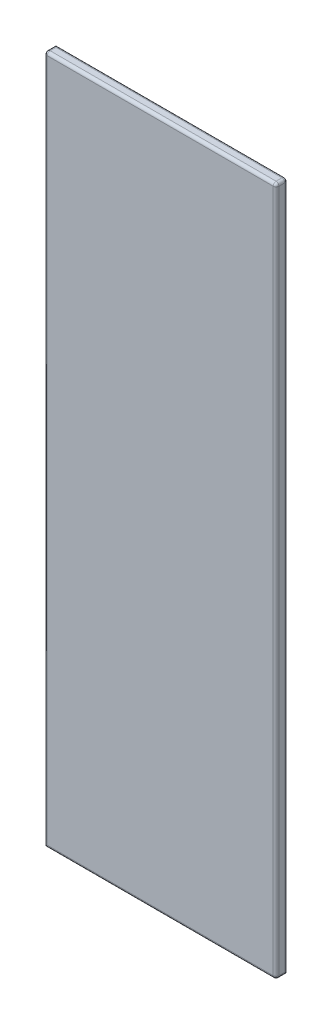
ISO-10303-21;
HEADER;
FILE_DESCRIPTION(('STEP AP214'),'2;1');
FILE_NAME('part.step','',(''),(''),'','','');
FILE_SCHEMA(('AUTOMOTIVE_DESIGN { 1 0 10303 214 1 1 1 1 }'));
ENDSEC;
DATA;
#1=APPLICATION_CONTEXT('core data for automotive mechanical design processes');
#2=APPLICATION_PROTOCOL_DEFINITION('international standard','automotive_design',2000,#1);
#3=PRODUCT_CONTEXT('',#1,'mechanical');
#4=PRODUCT('Part','Part','',(#3));
#5=PRODUCT_RELATED_PRODUCT_CATEGORY('part','',(#4));
#6=PRODUCT_DEFINITION_FORMATION('','',#4);
#7=PRODUCT_DEFINITION_CONTEXT('part definition',#1,'design');
#8=PRODUCT_DEFINITION('design','',#6,#7);
#9=PRODUCT_DEFINITION_SHAPE('','',#8);
#10=(LENGTH_UNIT() NAMED_UNIT(*) SI_UNIT(.MILLI.,.METRE.));
#11=(NAMED_UNIT(*) PLANE_ANGLE_UNIT() SI_UNIT($,.RADIAN.));
#12=(NAMED_UNIT(*) SI_UNIT($,.STERADIAN.) SOLID_ANGLE_UNIT());
#13=UNCERTAINTY_MEASURE_WITH_UNIT(LENGTH_MEASURE(1.E-05),#10,'distance_accuracy_value','');
#14=(GEOMETRIC_REPRESENTATION_CONTEXT(3) GLOBAL_UNCERTAINTY_ASSIGNED_CONTEXT((#13)) GLOBAL_UNIT_ASSIGNED_CONTEXT((#10,
#11,#12)) REPRESENTATION_CONTEXT('',''));
#15=CARTESIAN_POINT('',(0.,0.,0.));
#16=DIRECTION('',(0.,0.,1.));
#17=DIRECTION('',(1.,0.,0.));
#18=AXIS2_PLACEMENT_3D('',#15,#16,#17);
#19=CARTESIAN_POINT('',(200.,595.,20.));
#20=DIRECTION('',(-1.,0.,0.));
#21=DIRECTION('',(0.,-1.,0.));
#22=AXIS2_PLACEMENT_3D('',#19,#20,#21);
#23=PLANE('',#22);
#24=DIRECTION('',(0.,1.,0.));
#25=VECTOR('',#24,1.);
#26=CARTESIAN_POINT('',(200.,-595.,15.));
#27=LINE('',#26,#25);
#28=CARTESIAN_POINT('',(200.,590.,15.));
#29=VERTEX_POINT('',#28);
#30=CARTESIAN_POINT('',(200.,-590.,15.));
#31=VERTEX_POINT('',#30);
#32=EDGE_CURVE('E139',#29,#31,#27,.F.);
#33=ORIENTED_EDGE('',*,*,#32,.T.);
#34=DIRECTION('',(0.,0.,-1.));
#35=VECTOR('',#34,1.);
#36=CARTESIAN_POINT('',(200.,-590.,20.));
#37=LINE('',#36,#35);
#38=CARTESIAN_POINT('',(200.,-590.,5.));
#39=VERTEX_POINT('',#38);
#40=EDGE_CURVE('E146',#31,#39,#37,.T.);
#41=ORIENTED_EDGE('',*,*,#40,.T.);
#42=DIRECTION('',(0.,1.,0.));
#43=VECTOR('',#42,1.);
#44=CARTESIAN_POINT('',(200.,595.,5.));
#45=LINE('',#44,#43);
#46=CARTESIAN_POINT('',(200.,590.,5.));
#47=VERTEX_POINT('',#46);
#48=EDGE_CURVE('E142',#39,#47,#45,.T.);
#49=ORIENTED_EDGE('',*,*,#48,.T.);
#50=DIRECTION('',(0.,0.,-1.));
#51=VECTOR('',#50,1.);
#52=CARTESIAN_POINT('',(200.,590.,20.));
#53=LINE('',#52,#51);
#54=EDGE_CURVE('E119',#47,#29,#53,.F.);
#55=ORIENTED_EDGE('',*,*,#54,.T.);
#56=EDGE_LOOP('',(#33,#41,#49,#55));
#57=FACE_BOUND('',#56,.T.);
#58=ADVANCED_FACE('F39',(#57),#23,.F.);
#59=CARTESIAN_POINT('',(-200.,595.,20.));
#60=DIRECTION('',(0.,-1.,0.));
#61=DIRECTION('',(0.,0.,-1.));
#62=AXIS2_PLACEMENT_3D('',#59,#60,#61);
#63=PLANE('',#62);
#64=DIRECTION('',(-1.,0.,0.));
#65=VECTOR('',#64,1.);
#66=CARTESIAN_POINT('',(-200.,595.,5.));
#67=LINE('',#66,#65);
#68=CARTESIAN_POINT('',(195.,595.,5.));
#69=VERTEX_POINT('',#68);
#70=CARTESIAN_POINT('',(-195.,595.,5.));
#71=VERTEX_POINT('',#70);
#72=EDGE_CURVE('E160',#69,#71,#67,.T.);
#73=ORIENTED_EDGE('',*,*,#72,.T.);
#74=DIRECTION('',(0.,0.,-1.));
#75=VECTOR('',#74,1.);
#76=CARTESIAN_POINT('',(-195.,595.,20.));
#77=LINE('',#76,#75);
#78=CARTESIAN_POINT('',(-195.,595.,15.));
#79=VERTEX_POINT('',#78);
#80=EDGE_CURVE('E164',#71,#79,#77,.F.);
#81=ORIENTED_EDGE('',*,*,#80,.T.);
#82=DIRECTION('',(-1.,0.,0.));
#83=VECTOR('',#82,1.);
#84=CARTESIAN_POINT('',(200.,595.,15.));
#85=LINE('',#84,#83);
#86=CARTESIAN_POINT('',(195.,595.,15.));
#87=VERTEX_POINT('',#86);
#88=EDGE_CURVE('E157',#79,#87,#85,.F.);
#89=ORIENTED_EDGE('',*,*,#88,.T.);
#90=DIRECTION('',(0.,0.,-1.));
#91=VECTOR('',#90,1.);
#92=CARTESIAN_POINT('',(195.,595.,20.));
#93=LINE('',#92,#91);
#94=EDGE_CURVE('E154',#87,#69,#93,.T.);
#95=ORIENTED_EDGE('',*,*,#94,.T.);
#96=EDGE_LOOP('',(#73,#81,#89,#95));
#97=FACE_BOUND('',#96,.T.);
#98=ADVANCED_FACE('F291',(#97),#63,.F.);
#99=CARTESIAN_POINT('',(-200.,595.,20.));
#100=DIRECTION('',(1.,0.,0.));
#101=DIRECTION('',(0.,1.,0.));
#102=AXIS2_PLACEMENT_3D('',#99,#100,#101);
#103=PLANE('',#102);
#104=DIRECTION('',(0.,0.,-1.));
#105=VECTOR('',#104,1.);
#106=CARTESIAN_POINT('',(-200.,-595.,20.));
#107=LINE('',#106,#105);
#108=CARTESIAN_POINT('',(-200.,-595.,15.));
#109=VERTEX_POINT('',#108);
#110=CARTESIAN_POINT('',(-200.,-595.,0.));
#111=VERTEX_POINT('',#110);
#112=EDGE_CURVE('E113',#109,#111,#107,.T.);
#113=ORIENTED_EDGE('',*,*,#112,.F.);
#114=DIRECTION('',(0.,-1.,0.));
#115=VECTOR('',#114,1.);
#116=CARTESIAN_POINT('',(-200.,595.,15.));
#117=LINE('',#116,#115);
#118=CARTESIAN_POINT('',(-200.,590.,15.));
#119=VERTEX_POINT('',#118);
#120=EDGE_CURVE('E63',#109,#119,#117,.F.);
#121=ORIENTED_EDGE('',*,*,#120,.T.);
#122=DIRECTION('',(0.,0.,-1.));
#123=VECTOR('',#122,1.);
#124=CARTESIAN_POINT('',(-200.,590.,20.));
#125=LINE('',#124,#123);
#126=CARTESIAN_POINT('',(-200.,590.,0.));
#127=VERTEX_POINT('',#126);
#128=EDGE_CURVE('E125',#119,#127,#125,.T.);
#129=ORIENTED_EDGE('',*,*,#128,.T.);
#130=DIRECTION('',(0.,-1.,0.));
#131=VECTOR('',#130,1.);
#132=CARTESIAN_POINT('',(-200.,595.,0.));
#133=LINE('',#132,#131);
#134=EDGE_CURVE('E122',#127,#111,#133,.T.);
#135=ORIENTED_EDGE('',*,*,#134,.T.);
#136=EDGE_LOOP('',(#113,#121,#129,#135));
#137=FACE_BOUND('',#136,.T.);
#138=ADVANCED_FACE('F123',(#137),#103,.F.);
#139=CARTESIAN_POINT('',(-200.,-595.,20.));
#140=DIRECTION('',(0.,1.,0.));
#141=DIRECTION('',(0.,0.,1.));
#142=AXIS2_PLACEMENT_3D('',#139,#140,#141);
#143=PLANE('',#142);
#144=DIRECTION('',(0.,0.,-1.));
#145=VECTOR('',#144,1.);
#146=CARTESIAN_POINT('',(195.,-595.,20.));
#147=LINE('',#146,#145);
#148=CARTESIAN_POINT('',(195.,-595.,0.));
#149=VERTEX_POINT('',#148);
#150=CARTESIAN_POINT('',(195.,-595.,15.));
#151=VERTEX_POINT('',#150);
#152=EDGE_CURVE('E49',#149,#151,#147,.F.);
#153=ORIENTED_EDGE('',*,*,#152,.T.);
#154=DIRECTION('',(1.,0.,0.));
#155=VECTOR('',#154,1.);
#156=CARTESIAN_POINT('',(-200.,-595.,15.));
#157=LINE('',#156,#155);
#158=EDGE_CURVE('E11',#151,#109,#157,.F.);
#159=ORIENTED_EDGE('',*,*,#158,.T.);
#160=ORIENTED_EDGE('',*,*,#112,.T.);
#161=DIRECTION('',(1.,0.,0.));
#162=VECTOR('',#161,1.);
#163=CARTESIAN_POINT('',(-200.,-595.,0.));
#164=LINE('',#163,#162);
#165=EDGE_CURVE('E117',#111,#149,#164,.T.);
#166=ORIENTED_EDGE('',*,*,#165,.T.);
#167=EDGE_LOOP('',(#153,#159,#160,#166));
#168=FACE_BOUND('',#167,.T.);
#169=ADVANCED_FACE('F115',(#168),#143,.F.);
#170=CARTESIAN_POINT('',(0.,0.,20.));
#171=DIRECTION('',(0.,0.,1.));
#172=DIRECTION('',(1.,0.,0.));
#173=AXIS2_PLACEMENT_3D('',#170,#171,#172);
#174=PLANE('',#173);
#175=DIRECTION('',(1.,0.,0.));
#176=VECTOR('',#175,1.);
#177=CARTESIAN_POINT('',(200.,-590.,20.));
#178=LINE('',#177,#176);
#179=CARTESIAN_POINT('',(-195.,-590.,20.));
#180=VERTEX_POINT('',#179);
#181=CARTESIAN_POINT('',(195.,-590.,20.));
#182=VERTEX_POINT('',#181);
#183=EDGE_CURVE('E167',#180,#182,#178,.T.);
#184=ORIENTED_EDGE('',*,*,#183,.T.);
#185=DIRECTION('',(0.,1.,0.));
#186=VECTOR('',#185,1.);
#187=CARTESIAN_POINT('',(195.,595.,20.));
#188=LINE('',#187,#186);
#189=CARTESIAN_POINT('',(195.,590.,20.));
#190=VERTEX_POINT('',#189);
#191=EDGE_CURVE('E176',#182,#190,#188,.T.);
#192=ORIENTED_EDGE('',*,*,#191,.T.);
#193=DIRECTION('',(-1.,0.,0.));
#194=VECTOR('',#193,1.);
#195=CARTESIAN_POINT('',(-200.,590.,20.));
#196=LINE('',#195,#194);
#197=CARTESIAN_POINT('',(-195.,590.,20.));
#198=VERTEX_POINT('',#197);
#199=EDGE_CURVE('E173',#190,#198,#196,.T.);
#200=ORIENTED_EDGE('',*,*,#199,.T.);
#201=DIRECTION('',(0.,-1.,0.));
#202=VECTOR('',#201,1.);
#203=CARTESIAN_POINT('',(-195.,-595.,20.));
#204=LINE('',#203,#202);
#205=EDGE_CURVE('E170',#198,#180,#204,.T.);
#206=ORIENTED_EDGE('',*,*,#205,.T.);
#207=EDGE_LOOP('',(#184,#192,#200,#206));
#208=FACE_BOUND('',#207,.T.);
#209=ADVANCED_FACE('F283',(#208),#174,.T.);
#210=CARTESIAN_POINT('',(0.,0.,0.));
#211=DIRECTION('',(0.,0.,1.));
#212=DIRECTION('',(1.,0.,0.));
#213=AXIS2_PLACEMENT_3D('',#210,#211,#212);
#214=PLANE('',#213);
#215=DIRECTION('',(-1.,0.,0.));
#216=VECTOR('',#215,1.);
#217=CARTESIAN_POINT('',(0.,590.,0.));
#218=LINE('',#217,#216);
#219=CARTESIAN_POINT('',(195.,590.,0.));
#220=VERTEX_POINT('',#219);
#221=EDGE_CURVE('E149',#127,#220,#218,.F.);
#222=ORIENTED_EDGE('',*,*,#221,.T.);
#223=DIRECTION('',(0.,1.,0.));
#224=VECTOR('',#223,1.);
#225=CARTESIAN_POINT('',(195.,0.,0.));
#226=LINE('',#225,#224);
#227=EDGE_CURVE('E133',#220,#149,#226,.F.);
#228=ORIENTED_EDGE('',*,*,#227,.T.);
#229=ORIENTED_EDGE('',*,*,#165,.F.);
#230=ORIENTED_EDGE('',*,*,#134,.F.);
#231=EDGE_LOOP('',(#222,#228,#229,#230));
#232=FACE_BOUND('',#231,.T.);
#233=ADVANCED_FACE('F131',(#232),#214,.F.);
#234=CARTESIAN_POINT('',(-195.,0.,15.));
#235=DIRECTION('',(0.,1.,0.));
#236=DIRECTION('',(-1.,0.,0.));
#237=AXIS2_PLACEMENT_3D('',#234,#235,#236);
#238=CYLINDRICAL_SURFACE('',#237,5.);
#239=CARTESIAN_POINT('',(-195.,-590.,15.));
#240=DIRECTION('',(-0.707106781186548,0.707106781186547,0.));
#241=DIRECTION('',(-0.707106781186547,-0.707106781186548,0.));
#242=AXIS2_PLACEMENT_3D('',#239,#240,#241);
#243=ELLIPSE('',#242,7.07106781186547,5.);
#244=EDGE_CURVE('E230',#180,#109,#243,.F.);
#245=ORIENTED_EDGE('',*,*,#244,.F.);
#246=ORIENTED_EDGE('',*,*,#205,.F.);
#247=CARTESIAN_POINT('',(-195.,590.,15.));
#248=DIRECTION('',(0.,1.,0.));
#249=DIRECTION('',(0.,0.,1.));
#250=AXIS2_PLACEMENT_3D('',#247,#248,#249);
#251=CIRCLE('',#250,5.);
#252=EDGE_CURVE('E233',#119,#198,#251,.T.);
#253=ORIENTED_EDGE('',*,*,#252,.F.);
#254=ORIENTED_EDGE('',*,*,#120,.F.);
#255=EDGE_LOOP('',(#245,#246,#253,#254));
#256=FACE_BOUND('',#255,.T.);
#257=ADVANCED_FACE('F41',(#256),#238,.T.);
#258=CARTESIAN_POINT('',(0.,590.,15.));
#259=DIRECTION('',(1.,0.,0.));
#260=DIRECTION('',(0.,0.,-1.));
#261=AXIS2_PLACEMENT_3D('',#258,#259,#260);
#262=CYLINDRICAL_SURFACE('',#261,5.);
#263=CARTESIAN_POINT('',(-195.,590.,15.));
#264=DIRECTION('',(-1.,0.,0.));
#265=DIRECTION('',(0.,0.,1.));
#266=AXIS2_PLACEMENT_3D('',#263,#264,#265);
#267=CIRCLE('',#266,5.);
#268=EDGE_CURVE('E43',#198,#79,#267,.T.);
#269=ORIENTED_EDGE('',*,*,#268,.F.);
#270=ORIENTED_EDGE('',*,*,#199,.F.);
#271=CARTESIAN_POINT('',(195.,590.,15.));
#272=DIRECTION('',(1.,0.,0.));
#273=DIRECTION('',(0.,0.,-1.));
#274=AXIS2_PLACEMENT_3D('',#271,#272,#273);
#275=CIRCLE('',#274,5.);
#276=EDGE_CURVE('E223',#87,#190,#275,.T.);
#277=ORIENTED_EDGE('',*,*,#276,.F.);
#278=ORIENTED_EDGE('',*,*,#88,.F.);
#279=EDGE_LOOP('',(#269,#270,#277,#278));
#280=FACE_BOUND('',#279,.T.);
#281=ADVANCED_FACE('F286',(#280),#262,.T.);
#282=CARTESIAN_POINT('',(-195.,590.,15.));
#283=DIRECTION('',(0.,0.,1.));
#284=DIRECTION('',(1.,0.,0.));
#285=AXIS2_PLACEMENT_3D('',#282,#283,#284);
#286=SPHERICAL_SURFACE('',#285,5.);
#287=ORIENTED_EDGE('',*,*,#252,.T.);
#288=ORIENTED_EDGE('',*,*,#268,.T.);
#289=CARTESIAN_POINT('',(-195.,590.,15.));
#290=DIRECTION('',(0.,0.,1.));
#291=DIRECTION('',(1.,0.,0.));
#292=AXIS2_PLACEMENT_3D('',#289,#290,#291);
#293=CIRCLE('',#292,5.);
#294=EDGE_CURVE('E219',#119,#79,#293,.F.);
#295=ORIENTED_EDGE('',*,*,#294,.F.);
#296=EDGE_LOOP('',(#287,#288,#295));
#297=FACE_BOUND('',#296,.T.);
#298=ADVANCED_FACE('F241',(#297),#286,.T.);
#299=CARTESIAN_POINT('',(0.,-590.,15.));
#300=DIRECTION('',(-1.,0.,0.));
#301=DIRECTION('',(0.,0.,1.));
#302=AXIS2_PLACEMENT_3D('',#299,#300,#301);
#303=CYLINDRICAL_SURFACE('',#302,5.);
#304=ORIENTED_EDGE('',*,*,#244,.T.);
#305=ORIENTED_EDGE('',*,*,#158,.F.);
#306=CARTESIAN_POINT('',(195.,-590.,15.));
#307=DIRECTION('',(1.,0.,0.));
#308=DIRECTION('',(0.,0.,-1.));
#309=AXIS2_PLACEMENT_3D('',#306,#307,#308);
#310=CIRCLE('',#309,5.);
#311=EDGE_CURVE('E215',#182,#151,#310,.T.);
#312=ORIENTED_EDGE('',*,*,#311,.F.);
#313=ORIENTED_EDGE('',*,*,#183,.F.);
#314=EDGE_LOOP('',(#304,#305,#312,#313));
#315=FACE_BOUND('',#314,.T.);
#316=ADVANCED_FACE('F278',(#315),#303,.T.);
#317=CARTESIAN_POINT('',(195.,0.,15.));
#318=DIRECTION('',(0.,-1.,0.));
#319=DIRECTION('',(1.,0.,0.));
#320=AXIS2_PLACEMENT_3D('',#317,#318,#319);
#321=CYLINDRICAL_SURFACE('',#320,5.);
#322=CARTESIAN_POINT('',(195.,590.,15.));
#323=DIRECTION('',(0.,1.,0.));
#324=DIRECTION('',(0.,0.,1.));
#325=AXIS2_PLACEMENT_3D('',#322,#323,#324);
#326=CIRCLE('',#325,5.);
#327=EDGE_CURVE('E226',#190,#29,#326,.T.);
#328=ORIENTED_EDGE('',*,*,#327,.F.);
#329=ORIENTED_EDGE('',*,*,#191,.F.);
#330=CARTESIAN_POINT('',(195.,-590.,15.));
#331=DIRECTION('',(0.,-1.,0.));
#332=DIRECTION('',(0.,0.,-1.));
#333=AXIS2_PLACEMENT_3D('',#330,#331,#332);
#334=CIRCLE('',#333,5.);
#335=EDGE_CURVE('E211',#31,#182,#334,.T.);
#336=ORIENTED_EDGE('',*,*,#335,.F.);
#337=ORIENTED_EDGE('',*,*,#32,.F.);
#338=EDGE_LOOP('',(#328,#329,#336,#337));
#339=FACE_BOUND('',#338,.T.);
#340=ADVANCED_FACE('F318',(#339),#321,.T.);
#341=CARTESIAN_POINT('',(195.,590.,15.));
#342=DIRECTION('',(0.,0.,1.));
#343=DIRECTION('',(1.,0.,0.));
#344=AXIS2_PLACEMENT_3D('',#341,#342,#343);
#345=SPHERICAL_SURFACE('',#344,5.);
#346=ORIENTED_EDGE('',*,*,#276,.T.);
#347=ORIENTED_EDGE('',*,*,#327,.T.);
#348=CARTESIAN_POINT('',(195.,590.,15.));
#349=DIRECTION('',(0.,0.,1.));
#350=DIRECTION('',(1.,0.,0.));
#351=AXIS2_PLACEMENT_3D('',#348,#349,#350);
#352=CIRCLE('',#351,5.);
#353=EDGE_CURVE('E207',#87,#29,#352,.F.);
#354=ORIENTED_EDGE('',*,*,#353,.F.);
#355=EDGE_LOOP('',(#346,#347,#354));
#356=FACE_BOUND('',#355,.T.);
#357=ADVANCED_FACE('F289',(#356),#345,.T.);
#358=CARTESIAN_POINT('',(-195.,590.,20.));
#359=DIRECTION('',(0.,0.,-1.));
#360=DIRECTION('',(-1.,0.,0.));
#361=AXIS2_PLACEMENT_3D('',#358,#359,#360);
#362=CYLINDRICAL_SURFACE('',#361,5.);
#363=ORIENTED_EDGE('',*,*,#294,.T.);
#364=ORIENTED_EDGE('',*,*,#80,.F.);
#365=CARTESIAN_POINT('',(-195.,590.,5.));
#366=DIRECTION('',(0.707106781186547,0.,-0.707106781186547));
#367=DIRECTION('',(-0.707106781186547,0.,-0.707106781186547));
#368=AXIS2_PLACEMENT_3D('',#365,#366,#367);
#369=ELLIPSE('',#368,7.07106781186547,5.);
#370=EDGE_CURVE('E204',#127,#71,#369,.T.);
#371=ORIENTED_EDGE('',*,*,#370,.F.);
#372=ORIENTED_EDGE('',*,*,#128,.F.);
#373=EDGE_LOOP('',(#363,#364,#371,#372));
#374=FACE_BOUND('',#373,.T.);
#375=ADVANCED_FACE('F247',(#374),#362,.T.);
#376=CARTESIAN_POINT('',(195.,-590.,15.));
#377=DIRECTION('',(0.,0.,1.));
#378=DIRECTION('',(1.,0.,0.));
#379=AXIS2_PLACEMENT_3D('',#376,#377,#378);
#380=SPHERICAL_SURFACE('',#379,5.);
#381=ORIENTED_EDGE('',*,*,#335,.T.);
#382=ORIENTED_EDGE('',*,*,#311,.T.);
#383=CARTESIAN_POINT('',(195.,-590.,15.));
#384=DIRECTION('',(0.,0.,1.));
#385=DIRECTION('',(1.,0.,0.));
#386=AXIS2_PLACEMENT_3D('',#383,#384,#385);
#387=CIRCLE('',#386,5.);
#388=EDGE_CURVE('E200',#31,#151,#387,.F.);
#389=ORIENTED_EDGE('',*,*,#388,.F.);
#390=EDGE_LOOP('',(#381,#382,#389));
#391=FACE_BOUND('',#390,.T.);
#392=ADVANCED_FACE('F274',(#391),#380,.T.);
#393=CARTESIAN_POINT('',(195.,590.,20.));
#394=DIRECTION('',(0.,0.,-1.));
#395=DIRECTION('',(-1.,0.,0.));
#396=AXIS2_PLACEMENT_3D('',#393,#394,#395);
#397=CYLINDRICAL_SURFACE('',#396,5.);
#398=ORIENTED_EDGE('',*,*,#353,.T.);
#399=ORIENTED_EDGE('',*,*,#54,.F.);
#400=CARTESIAN_POINT('',(195.,590.,5.));
#401=DIRECTION('',(0.,0.,-1.));
#402=DIRECTION('',(-1.,0.,0.));
#403=AXIS2_PLACEMENT_3D('',#400,#401,#402);
#404=CIRCLE('',#403,5.);
#405=EDGE_CURVE('E196',#69,#47,#404,.T.);
#406=ORIENTED_EDGE('',*,*,#405,.F.);
#407=ORIENTED_EDGE('',*,*,#94,.F.);
#408=EDGE_LOOP('',(#398,#399,#406,#407));
#409=FACE_BOUND('',#408,.T.);
#410=ADVANCED_FACE('F264',(#409),#397,.T.);
#411=CARTESIAN_POINT('',(-200.,590.,5.));
#412=DIRECTION('',(-1.,0.,0.));
#413=DIRECTION('',(0.,0.,1.));
#414=AXIS2_PLACEMENT_3D('',#411,#412,#413);
#415=CYLINDRICAL_SURFACE('',#414,5.);
#416=ORIENTED_EDGE('',*,*,#370,.T.);
#417=ORIENTED_EDGE('',*,*,#72,.F.);
#418=CARTESIAN_POINT('',(195.,590.,5.));
#419=DIRECTION('',(1.,0.,0.));
#420=DIRECTION('',(0.,1.,0.));
#421=AXIS2_PLACEMENT_3D('',#418,#419,#420);
#422=CIRCLE('',#421,5.);
#423=EDGE_CURVE('E192',#220,#69,#422,.T.);
#424=ORIENTED_EDGE('',*,*,#423,.F.);
#425=ORIENTED_EDGE('',*,*,#221,.F.);
#426=EDGE_LOOP('',(#416,#417,#424,#425));
#427=FACE_BOUND('',#426,.T.);
#428=ADVANCED_FACE('F252',(#427),#415,.T.);
#429=CARTESIAN_POINT('',(195.,-590.,20.));
#430=DIRECTION('',(0.,0.,-1.));
#431=DIRECTION('',(-1.,0.,0.));
#432=AXIS2_PLACEMENT_3D('',#429,#430,#431);
#433=CYLINDRICAL_SURFACE('',#432,5.);
#434=ORIENTED_EDGE('',*,*,#388,.T.);
#435=ORIENTED_EDGE('',*,*,#152,.F.);
#436=CARTESIAN_POINT('',(195.,-590.,5.));
#437=DIRECTION('',(0.,0.707106781186547,-0.707106781186547));
#438=DIRECTION('',(0.,-0.707106781186547,-0.707106781186547));
#439=AXIS2_PLACEMENT_3D('',#436,#437,#438);
#440=ELLIPSE('',#439,7.07106781186547,5.);
#441=EDGE_CURVE('E189',#39,#149,#440,.T.);
#442=ORIENTED_EDGE('',*,*,#441,.F.);
#443=ORIENTED_EDGE('',*,*,#40,.F.);
#444=EDGE_LOOP('',(#434,#435,#442,#443));
#445=FACE_BOUND('',#444,.T.);
#446=ADVANCED_FACE('F271',(#445),#433,.T.);
#447=CARTESIAN_POINT('',(195.,590.,5.));
#448=DIRECTION('',(0.,1.,0.));
#449=DIRECTION('',(-1.,0.,0.));
#450=AXIS2_PLACEMENT_3D('',#447,#448,#449);
#451=SPHERICAL_SURFACE('',#450,5.);
#452=ORIENTED_EDGE('',*,*,#423,.T.);
#453=ORIENTED_EDGE('',*,*,#405,.T.);
#454=CARTESIAN_POINT('',(195.,590.,5.));
#455=DIRECTION('',(0.,1.,0.));
#456=DIRECTION('',(0.,0.,1.));
#457=AXIS2_PLACEMENT_3D('',#454,#455,#456);
#458=CIRCLE('',#457,5.);
#459=EDGE_CURVE('E186',#220,#47,#458,.F.);
#460=ORIENTED_EDGE('',*,*,#459,.F.);
#461=EDGE_LOOP('',(#452,#453,#460));
#462=FACE_BOUND('',#461,.T.);
#463=ADVANCED_FACE('F260',(#462),#451,.T.);
#464=CARTESIAN_POINT('',(195.,595.,5.));
#465=DIRECTION('',(0.,1.,0.));
#466=DIRECTION('',(-1.,0.,0.));
#467=AXIS2_PLACEMENT_3D('',#464,#465,#466);
#468=CYLINDRICAL_SURFACE('',#467,5.);
#469=ORIENTED_EDGE('',*,*,#441,.T.);
#470=ORIENTED_EDGE('',*,*,#227,.F.);
#471=ORIENTED_EDGE('',*,*,#459,.T.);
#472=ORIENTED_EDGE('',*,*,#48,.F.);
#473=EDGE_LOOP('',(#469,#470,#471,#472));
#474=FACE_BOUND('',#473,.T.);
#475=ADVANCED_FACE('F257',(#474),#468,.T.);
#476=CLOSED_SHELL('',(#58,#98,#138,#169,#209,#233,#257,#281,#298,#316,#340,#357,#375,#392,#410,
#428,#446,#463,#475));
#477=MANIFOLD_SOLID_BREP('B2',#476);
#478=ADVANCED_BREP_SHAPE_REPRESENTATION('',(#18,#477),#14);
#479=SHAPE_DEFINITION_REPRESENTATION(#9,#478);
ENDSEC;
END-ISO-10303-21;
